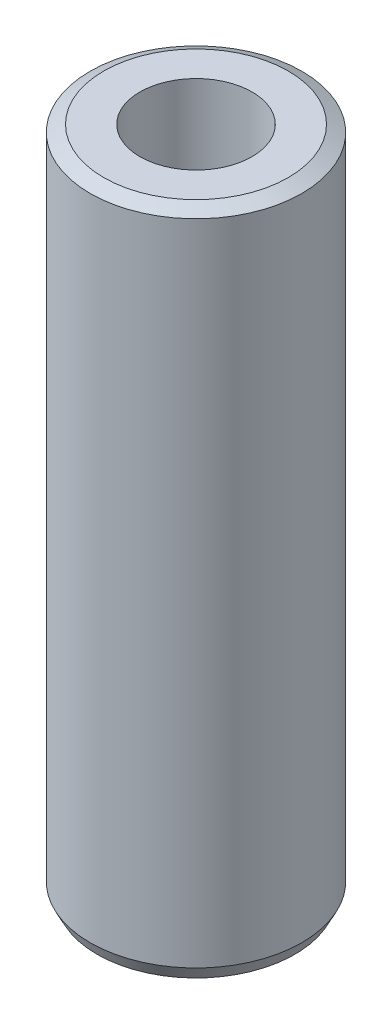
ISO-10303-21;
HEADER;
FILE_DESCRIPTION(('STEP AP214'),'2;1');
FILE_NAME('part.step','',(''),(''),'','','');
FILE_SCHEMA(('AUTOMOTIVE_DESIGN { 1 0 10303 214 1 1 1 1 }'));
ENDSEC;
DATA;
#1=APPLICATION_CONTEXT('core data for automotive mechanical design processes');
#2=APPLICATION_PROTOCOL_DEFINITION('international standard','automotive_design',2000,#1);
#3=PRODUCT_CONTEXT('',#1,'mechanical');
#4=PRODUCT('Part','Part','',(#3));
#5=PRODUCT_RELATED_PRODUCT_CATEGORY('part','',(#4));
#6=PRODUCT_DEFINITION_FORMATION('','',#4);
#7=PRODUCT_DEFINITION_CONTEXT('part definition',#1,'design');
#8=PRODUCT_DEFINITION('design','',#6,#7);
#9=PRODUCT_DEFINITION_SHAPE('','',#8);
#10=(LENGTH_UNIT() NAMED_UNIT(*) SI_UNIT(.MILLI.,.METRE.));
#11=(NAMED_UNIT(*) PLANE_ANGLE_UNIT() SI_UNIT($,.RADIAN.));
#12=(NAMED_UNIT(*) SI_UNIT($,.STERADIAN.) SOLID_ANGLE_UNIT());
#13=UNCERTAINTY_MEASURE_WITH_UNIT(LENGTH_MEASURE(1.E-05),#10,'distance_accuracy_value','');
#14=(GEOMETRIC_REPRESENTATION_CONTEXT(3) GLOBAL_UNCERTAINTY_ASSIGNED_CONTEXT((#13)) GLOBAL_UNIT_ASSIGNED_CONTEXT((#10,
#11,#12)) REPRESENTATION_CONTEXT('',''));
#15=CARTESIAN_POINT('',(0.,0.,0.));
#16=DIRECTION('',(0.,0.,1.));
#17=DIRECTION('',(1.,0.,0.));
#18=AXIS2_PLACEMENT_3D('',#15,#16,#17);
#19=CARTESIAN_POINT('',(0.,126.449340938901,0.));
#20=DIRECTION('',(0.,-1.,0.));
#21=DIRECTION('',(0.,0.,-1.));
#22=AXIS2_PLACEMENT_3D('',#19,#20,#21);
#23=CYLINDRICAL_SURFACE('',#22,20.);
#24=CARTESIAN_POINT('',(0.,125.137151939512,0.));
#25=DIRECTION('',(0.,1.,0.));
#26=DIRECTION('',(0.,0.,1.));
#27=AXIS2_PLACEMENT_3D('',#24,#25,#26);
#28=CIRCLE('',#27,20.);
#29=CARTESIAN_POINT('',(0.,125.137151939512,20.));
#30=VERTEX_POINT('',#29);
#31=EDGE_CURVE('E50',#30,#30,#28,.F.);
#32=ORIENTED_EDGE('',*,*,#31,.T.);
#33=EDGE_LOOP('',(#32));
#34=FACE_BOUND('',#33,.T.);
#35=CARTESIAN_POINT('',(0.,2.56528735614604,0.));
#36=DIRECTION('',(0.,1.,0.));
#37=DIRECTION('',(0.,0.,1.));
#38=AXIS2_PLACEMENT_3D('',#35,#36,#37);
#39=CIRCLE('',#38,20.);
#40=CARTESIAN_POINT('',(0.,2.56528735614604,20.));
#41=VERTEX_POINT('',#40);
#42=EDGE_CURVE('E51',#41,#41,#39,.T.);
#43=ORIENTED_EDGE('',*,*,#42,.T.);
#44=EDGE_LOOP('',(#43));
#45=FACE_BOUND('',#44,.T.);
#46=ADVANCED_FACE('F39',(#34,#45),#23,.T.);
#47=CARTESIAN_POINT('',(0.,126.449340938901,0.));
#48=DIRECTION('',(0.,1.,0.));
#49=DIRECTION('',(0.,0.,1.));
#50=AXIS2_PLACEMENT_3D('',#47,#48,#49);
#51=PLANE('',#50);
#52=CARTESIAN_POINT('',(0.,126.449340938901,0.));
#53=DIRECTION('',(0.,1.,0.));
#54=DIRECTION('',(0.,0.,1.));
#55=AXIS2_PLACEMENT_3D('',#52,#53,#54);
#56=CIRCLE('',#55,17.434712643854);
#57=CARTESIAN_POINT('',(0.,126.449340938901,17.434712643854));
#58=VERTEX_POINT('',#57);
#59=EDGE_CURVE('E54',#58,#58,#56,.T.);
#60=ORIENTED_EDGE('',*,*,#59,.T.);
#61=EDGE_LOOP('',(#60));
#62=FACE_BOUND('',#61,.T.);
#63=CARTESIAN_POINT('',(0.,126.449340938901,0.));
#64=DIRECTION('',(0.,1.,0.));
#65=DIRECTION('',(0.,0.,1.));
#66=AXIS2_PLACEMENT_3D('',#63,#64,#65);
#67=CIRCLE('',#66,10.5960656926418);
#68=CARTESIAN_POINT('',(0.,126.449340938901,10.5960656926418));
#69=VERTEX_POINT('',#68);
#70=EDGE_CURVE('E58',#69,#69,#67,.T.);
#71=ORIENTED_EDGE('',*,*,#70,.F.);
#72=EDGE_LOOP('',(#71));
#73=FACE_BOUND('',#72,.T.);
#74=ADVANCED_FACE('F69',(#62,#73),#51,.T.);
#75=CARTESIAN_POINT('',(0.,0.,0.));
#76=DIRECTION('',(0.,1.,0.));
#77=DIRECTION('',(0.,0.,1.));
#78=AXIS2_PLACEMENT_3D('',#75,#76,#77);
#79=PLANE('',#78);
#80=CARTESIAN_POINT('',(0.,0.,0.));
#81=DIRECTION('',(0.,1.,0.));
#82=DIRECTION('',(0.,0.,1.));
#83=AXIS2_PLACEMENT_3D('',#80,#81,#82);
#84=CIRCLE('',#83,18.6878110006107);
#85=CARTESIAN_POINT('',(0.,0.,18.6878110006107));
#86=VERTEX_POINT('',#85);
#87=EDGE_CURVE('E10',#86,#86,#84,.F.);
#88=ORIENTED_EDGE('',*,*,#87,.T.);
#89=EDGE_LOOP('',(#88));
#90=FACE_BOUND('',#89,.T.);
#91=CARTESIAN_POINT('',(0.,0.,0.));
#92=DIRECTION('',(0.,1.,0.));
#93=DIRECTION('',(0.,0.,1.));
#94=AXIS2_PLACEMENT_3D('',#91,#92,#93);
#95=CIRCLE('',#94,10.5960656926418);
#96=CARTESIAN_POINT('',(0.,0.,10.5960656926418));
#97=VERTEX_POINT('',#96);
#98=EDGE_CURVE('E63',#97,#97,#95,.T.);
#99=ORIENTED_EDGE('',*,*,#98,.T.);
#100=EDGE_LOOP('',(#99));
#101=FACE_BOUND('',#100,.T.);
#102=ADVANCED_FACE('F75',(#90,#101),#79,.F.);
#103=CARTESIAN_POINT('',(0.,126.449340938901,0.));
#104=DIRECTION('',(0.,-1.,0.));
#105=DIRECTION('',(0.,0.,-1.));
#106=AXIS2_PLACEMENT_3D('',#103,#104,#105);
#107=CYLINDRICAL_SURFACE('',#106,10.5960656926418);
#108=ORIENTED_EDGE('',*,*,#70,.T.);
#109=EDGE_LOOP('',(#108));
#110=FACE_BOUND('',#109,.T.);
#111=ORIENTED_EDGE('',*,*,#98,.F.);
#112=EDGE_LOOP('',(#111));
#113=FACE_BOUND('',#112,.T.);
#114=ADVANCED_FACE('F70',(#110,#113),#107,.F.);
#115=CARTESIAN_POINT('',(0.,126.449340938901,0.));
#116=DIRECTION('',(0.,-1.,0.));
#117=DIRECTION('',(0.,0.,-1.));
#118=AXIS2_PLACEMENT_3D('',#115,#116,#117);
#119=CONICAL_SURFACE('',#118,17.434712643854,1.0979773453082);
#120=ORIENTED_EDGE('',*,*,#31,.F.);
#121=EDGE_LOOP('',(#120));
#122=FACE_BOUND('',#121,.T.);
#123=ORIENTED_EDGE('',*,*,#59,.F.);
#124=EDGE_LOOP('',(#123));
#125=FACE_BOUND('',#124,.T.);
#126=ADVANCED_FACE('F81',(#122,#125),#119,.T.);
#127=CARTESIAN_POINT('',(0.,2.56528735614604,0.));
#128=DIRECTION('',(0.,1.,0.));
#129=DIRECTION('',(0.,0.,1.));
#130=AXIS2_PLACEMENT_3D('',#127,#128,#129);
#131=CONICAL_SURFACE('',#130,20.,0.472818981486707);
#132=ORIENTED_EDGE('',*,*,#87,.F.);
#133=EDGE_LOOP('',(#132));
#134=FACE_BOUND('',#133,.T.);
#135=ORIENTED_EDGE('',*,*,#42,.F.);
#136=EDGE_LOOP('',(#135));
#137=FACE_BOUND('',#136,.T.);
#138=ADVANCED_FACE('F45',(#134,#137),#131,.T.);
#139=CLOSED_SHELL('',(#46,#74,#102,#114,#126,#138));
#140=MANIFOLD_SOLID_BREP('B2',#139);
#141=ADVANCED_BREP_SHAPE_REPRESENTATION('',(#18,#140),#14);
#142=SHAPE_DEFINITION_REPRESENTATION(#9,#141);
ENDSEC;
END-ISO-10303-21;
